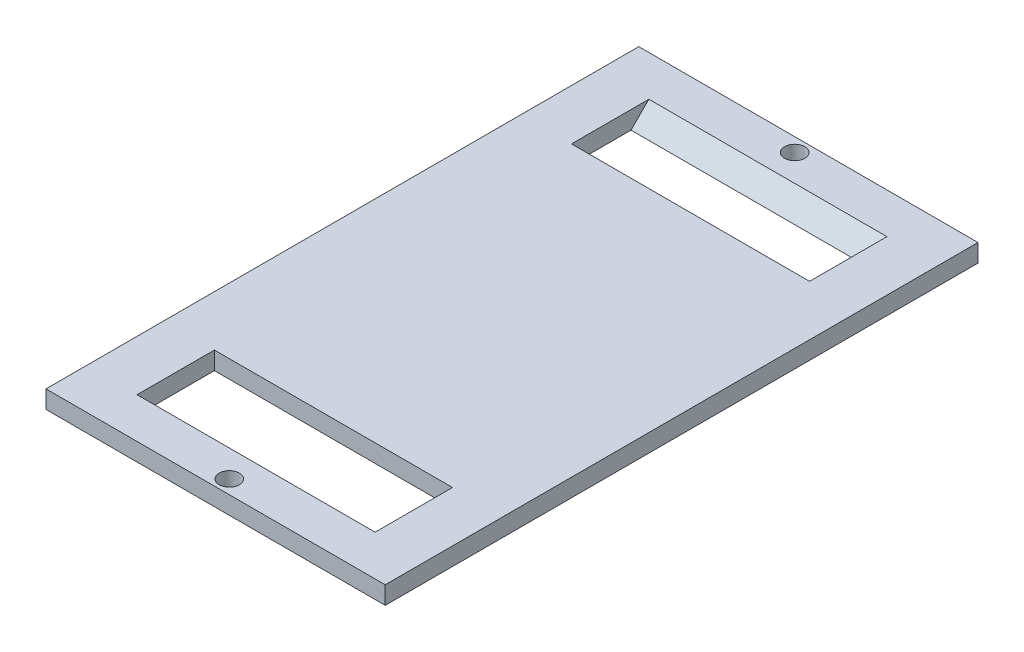
ISO-10303-21;
HEADER;
FILE_DESCRIPTION(('STEP AP214'),'2;1');
FILE_NAME('part.step','',(''),(''),'','','');
FILE_SCHEMA(('AUTOMOTIVE_DESIGN { 1 0 10303 214 1 1 1 1 }'));
ENDSEC;
DATA;
#1=APPLICATION_CONTEXT('core data for automotive mechanical design processes');
#2=APPLICATION_PROTOCOL_DEFINITION('international standard','automotive_design',2000,#1);
#3=PRODUCT_CONTEXT('',#1,'mechanical');
#4=PRODUCT('Part','Part','',(#3));
#5=PRODUCT_RELATED_PRODUCT_CATEGORY('part','',(#4));
#6=PRODUCT_DEFINITION_FORMATION('','',#4);
#7=PRODUCT_DEFINITION_CONTEXT('part definition',#1,'design');
#8=PRODUCT_DEFINITION('design','',#6,#7);
#9=PRODUCT_DEFINITION_SHAPE('','',#8);
#10=(LENGTH_UNIT() NAMED_UNIT(*) SI_UNIT(.MILLI.,.METRE.));
#11=(NAMED_UNIT(*) PLANE_ANGLE_UNIT() SI_UNIT($,.RADIAN.));
#12=(NAMED_UNIT(*) SI_UNIT($,.STERADIAN.) SOLID_ANGLE_UNIT());
#13=UNCERTAINTY_MEASURE_WITH_UNIT(LENGTH_MEASURE(1.E-05),#10,'distance_accuracy_value','');
#14=(GEOMETRIC_REPRESENTATION_CONTEXT(3) GLOBAL_UNCERTAINTY_ASSIGNED_CONTEXT((#13)) GLOBAL_UNIT_ASSIGNED_CONTEXT((#10,
#11,#12)) REPRESENTATION_CONTEXT('',''));
#15=CARTESIAN_POINT('',(0.,0.,0.));
#16=DIRECTION('',(0.,0.,1.));
#17=DIRECTION('',(1.,0.,0.));
#18=AXIS2_PLACEMENT_3D('',#15,#16,#17);
#19=CARTESIAN_POINT('',(0.,3.,0.));
#20=DIRECTION('',(0.,1.,0.));
#21=DIRECTION('',(0.,0.,1.));
#22=AXIS2_PLACEMENT_3D('',#19,#20,#21);
#23=PLANE('',#22);
#24=DIRECTION('',(0.,0.,-1.));
#25=VECTOR('',#24,1.);
#26=CARTESIAN_POINT('',(20.,3.,30.));
#27=LINE('',#26,#25);
#28=CARTESIAN_POINT('',(20.,3.,43.));
#29=VERTEX_POINT('',#28);
#30=CARTESIAN_POINT('',(20.,3.,30.));
#31=VERTEX_POINT('',#30);
#32=EDGE_CURVE('E50',#29,#31,#27,.T.);
#33=ORIENTED_EDGE('',*,*,#32,.F.);
#34=DIRECTION('',(-1.,0.,0.));
#35=VECTOR('',#34,1.);
#36=CARTESIAN_POINT('',(-20.,3.,43.));
#37=LINE('',#36,#35);
#38=CARTESIAN_POINT('',(-20.,3.,43.));
#39=VERTEX_POINT('',#38);
#40=EDGE_CURVE('E223',#29,#39,#37,.T.);
#41=ORIENTED_EDGE('',*,*,#40,.T.);
#42=DIRECTION('',(0.,0.,1.));
#43=VECTOR('',#42,1.);
#44=CARTESIAN_POINT('',(-20.,3.,30.));
#45=LINE('',#44,#43);
#46=CARTESIAN_POINT('',(-20.,3.,30.));
#47=VERTEX_POINT('',#46);
#48=EDGE_CURVE('E58',#47,#39,#45,.T.);
#49=ORIENTED_EDGE('',*,*,#48,.F.);
#50=DIRECTION('',(-1.,0.,0.));
#51=VECTOR('',#50,1.);
#52=CARTESIAN_POINT('',(-20.,3.,30.));
#53=LINE('',#52,#51);
#54=EDGE_CURVE('E146',#31,#47,#53,.T.);
#55=ORIENTED_EDGE('',*,*,#54,.F.);
#56=EDGE_LOOP('',(#33,#41,#49,#55));
#57=FACE_BOUND('',#56,.T.);
#58=DIRECTION('',(0.,0.,1.));
#59=VECTOR('',#58,1.);
#60=CARTESIAN_POINT('',(-20.,3.,-40.));
#61=LINE('',#60,#59);
#62=CARTESIAN_POINT('',(-20.,3.,-43.));
#63=VERTEX_POINT('',#62);
#64=CARTESIAN_POINT('',(-20.,3.,-30.));
#65=VERTEX_POINT('',#64);
#66=EDGE_CURVE('E170',#63,#65,#61,.T.);
#67=ORIENTED_EDGE('',*,*,#66,.F.);
#68=DIRECTION('',(1.,0.,0.));
#69=VECTOR('',#68,1.);
#70=CARTESIAN_POINT('',(20.,3.,-43.));
#71=LINE('',#70,#69);
#72=CARTESIAN_POINT('',(20.,3.,-43.));
#73=VERTEX_POINT('',#72);
#74=EDGE_CURVE('E220',#63,#73,#71,.T.);
#75=ORIENTED_EDGE('',*,*,#74,.T.);
#76=DIRECTION('',(0.,0.,-1.));
#77=VECTOR('',#76,1.);
#78=CARTESIAN_POINT('',(20.,3.,-40.));
#79=LINE('',#78,#77);
#80=CARTESIAN_POINT('',(20.,3.,-30.));
#81=VERTEX_POINT('',#80);
#82=EDGE_CURVE('E153',#81,#73,#79,.T.);
#83=ORIENTED_EDGE('',*,*,#82,.F.);
#84=DIRECTION('',(1.,0.,0.));
#85=VECTOR('',#84,1.);
#86=CARTESIAN_POINT('',(-20.,3.,-30.));
#87=LINE('',#86,#85);
#88=EDGE_CURVE('E159',#65,#81,#87,.T.);
#89=ORIENTED_EDGE('',*,*,#88,.F.);
#90=EDGE_LOOP('',(#67,#75,#83,#89));
#91=FACE_BOUND('',#90,.T.);
#92=CARTESIAN_POINT('',(0.,3.,-47.5));
#93=DIRECTION('',(0.,1.,0.));
#94=DIRECTION('',(0.,0.,1.));
#95=AXIS2_PLACEMENT_3D('',#92,#93,#94);
#96=CIRCLE('',#95,1.7);
#97=CARTESIAN_POINT('',(0.,3.,-45.8));
#98=VERTEX_POINT('',#97);
#99=EDGE_CURVE('E185',#98,#98,#96,.T.);
#100=ORIENTED_EDGE('',*,*,#99,.F.);
#101=EDGE_LOOP('',(#100));
#102=FACE_BOUND('',#101,.T.);
#103=DIRECTION('',(0.,0.,-1.));
#104=VECTOR('',#103,1.);
#105=CARTESIAN_POINT('',(28.5,3.,-49.8));
#106=LINE('',#105,#104);
#107=CARTESIAN_POINT('',(28.5,3.,49.8));
#108=VERTEX_POINT('',#107);
#109=CARTESIAN_POINT('',(28.5,3.,-49.8));
#110=VERTEX_POINT('',#109);
#111=EDGE_CURVE('E191',#108,#110,#106,.T.);
#112=ORIENTED_EDGE('',*,*,#111,.T.);
#113=DIRECTION('',(-1.,0.,0.));
#114=VECTOR('',#113,1.);
#115=CARTESIAN_POINT('',(-28.5,3.,-49.8));
#116=LINE('',#115,#114);
#117=CARTESIAN_POINT('',(-28.5,3.,-49.8));
#118=VERTEX_POINT('',#117);
#119=EDGE_CURVE('E194',#110,#118,#116,.T.);
#120=ORIENTED_EDGE('',*,*,#119,.T.);
#121=DIRECTION('',(0.,0.,1.));
#122=VECTOR('',#121,1.);
#123=CARTESIAN_POINT('',(-28.5,3.,-49.8));
#124=LINE('',#123,#122);
#125=CARTESIAN_POINT('',(-28.5,3.,49.8));
#126=VERTEX_POINT('',#125);
#127=EDGE_CURVE('E197',#118,#126,#124,.T.);
#128=ORIENTED_EDGE('',*,*,#127,.T.);
#129=DIRECTION('',(1.,0.,0.));
#130=VECTOR('',#129,1.);
#131=CARTESIAN_POINT('',(-28.5,3.,49.8));
#132=LINE('',#131,#130);
#133=EDGE_CURVE('E199',#126,#108,#132,.T.);
#134=ORIENTED_EDGE('',*,*,#133,.T.);
#135=EDGE_LOOP('',(#112,#120,#128,#134));
#136=FACE_BOUND('',#135,.T.);
#137=CARTESIAN_POINT('',(0.,3.,47.5));
#138=DIRECTION('',(0.,1.,0.));
#139=DIRECTION('',(0.,0.,1.));
#140=AXIS2_PLACEMENT_3D('',#137,#138,#139);
#141=CIRCLE('',#140,1.7);
#142=CARTESIAN_POINT('',(0.,3.,49.2));
#143=VERTEX_POINT('',#142);
#144=EDGE_CURVE('E179',#143,#143,#141,.T.);
#145=ORIENTED_EDGE('',*,*,#144,.F.);
#146=EDGE_LOOP('',(#145));
#147=FACE_BOUND('',#146,.T.);
#148=ADVANCED_FACE('F35',(#57,#91,#102,#136,#147),#23,.T.);
#149=CARTESIAN_POINT('',(0.,0.,0.));
#150=DIRECTION('',(0.,1.,0.));
#151=DIRECTION('',(0.,0.,1.));
#152=AXIS2_PLACEMENT_3D('',#149,#150,#151);
#153=PLANE('',#152);
#154=DIRECTION('',(1.,0.,0.));
#155=VECTOR('',#154,1.);
#156=CARTESIAN_POINT('',(-20.,0.,40.));
#157=LINE('',#156,#155);
#158=CARTESIAN_POINT('',(-20.,0.,40.));
#159=VERTEX_POINT('',#158);
#160=CARTESIAN_POINT('',(20.,0.,40.));
#161=VERTEX_POINT('',#160);
#162=EDGE_CURVE('E132',#159,#161,#157,.T.);
#163=ORIENTED_EDGE('',*,*,#162,.T.);
#164=DIRECTION('',(0.,0.,-1.));
#165=VECTOR('',#164,1.);
#166=CARTESIAN_POINT('',(20.,0.,30.));
#167=LINE('',#166,#165);
#168=CARTESIAN_POINT('',(20.,0.,30.));
#169=VERTEX_POINT('',#168);
#170=EDGE_CURVE('E127',#161,#169,#167,.T.);
#171=ORIENTED_EDGE('',*,*,#170,.T.);
#172=DIRECTION('',(-1.,0.,0.));
#173=VECTOR('',#172,1.);
#174=CARTESIAN_POINT('',(-20.,0.,30.));
#175=LINE('',#174,#173);
#176=CARTESIAN_POINT('',(-20.,0.,30.));
#177=VERTEX_POINT('',#176);
#178=EDGE_CURVE('E136',#169,#177,#175,.T.);
#179=ORIENTED_EDGE('',*,*,#178,.T.);
#180=DIRECTION('',(0.,0.,1.));
#181=VECTOR('',#180,1.);
#182=CARTESIAN_POINT('',(-20.,0.,30.));
#183=LINE('',#182,#181);
#184=EDGE_CURVE('E140',#177,#159,#183,.T.);
#185=ORIENTED_EDGE('',*,*,#184,.T.);
#186=EDGE_LOOP('',(#163,#171,#179,#185));
#187=FACE_BOUND('',#186,.T.);
#188=DIRECTION('',(1.,0.,0.));
#189=VECTOR('',#188,1.);
#190=CARTESIAN_POINT('',(-20.,0.,-30.));
#191=LINE('',#190,#189);
#192=CARTESIAN_POINT('',(-20.,0.,-30.));
#193=VERTEX_POINT('',#192);
#194=CARTESIAN_POINT('',(20.,0.,-30.));
#195=VERTEX_POINT('',#194);
#196=EDGE_CURVE('E165',#193,#195,#191,.T.);
#197=ORIENTED_EDGE('',*,*,#196,.T.);
#198=DIRECTION('',(0.,0.,-1.));
#199=VECTOR('',#198,1.);
#200=CARTESIAN_POINT('',(20.,0.,-40.));
#201=LINE('',#200,#199);
#202=CARTESIAN_POINT('',(20.,0.,-40.));
#203=VERTEX_POINT('',#202);
#204=EDGE_CURVE('E155',#195,#203,#201,.T.);
#205=ORIENTED_EDGE('',*,*,#204,.T.);
#206=DIRECTION('',(-1.,0.,0.));
#207=VECTOR('',#206,1.);
#208=CARTESIAN_POINT('',(-20.,0.,-40.));
#209=LINE('',#208,#207);
#210=CARTESIAN_POINT('',(-20.,0.,-40.));
#211=VERTEX_POINT('',#210);
#212=EDGE_CURVE('E158',#203,#211,#209,.T.);
#213=ORIENTED_EDGE('',*,*,#212,.T.);
#214=DIRECTION('',(0.,0.,1.));
#215=VECTOR('',#214,1.);
#216=CARTESIAN_POINT('',(-20.,0.,-40.));
#217=LINE('',#216,#215);
#218=EDGE_CURVE('E162',#211,#193,#217,.T.);
#219=ORIENTED_EDGE('',*,*,#218,.T.);
#220=EDGE_LOOP('',(#197,#205,#213,#219));
#221=FACE_BOUND('',#220,.T.);
#222=DIRECTION('',(0.,0.,-1.));
#223=VECTOR('',#222,1.);
#224=CARTESIAN_POINT('',(28.5,0.,-49.8));
#225=LINE('',#224,#223);
#226=CARTESIAN_POINT('',(28.5,0.,49.8));
#227=VERTEX_POINT('',#226);
#228=CARTESIAN_POINT('',(28.5,0.,-49.8));
#229=VERTEX_POINT('',#228);
#230=EDGE_CURVE('E188',#227,#229,#225,.T.);
#231=ORIENTED_EDGE('',*,*,#230,.F.);
#232=DIRECTION('',(1.,0.,0.));
#233=VECTOR('',#232,1.);
#234=CARTESIAN_POINT('',(-28.5,0.,49.8));
#235=LINE('',#234,#233);
#236=CARTESIAN_POINT('',(-28.5,0.,49.8));
#237=VERTEX_POINT('',#236);
#238=EDGE_CURVE('E195',#237,#227,#235,.T.);
#239=ORIENTED_EDGE('',*,*,#238,.F.);
#240=DIRECTION('',(0.,0.,1.));
#241=VECTOR('',#240,1.);
#242=CARTESIAN_POINT('',(-28.5,0.,-49.8));
#243=LINE('',#242,#241);
#244=CARTESIAN_POINT('',(-28.5,0.,-49.8));
#245=VERTEX_POINT('',#244);
#246=EDGE_CURVE('E206',#245,#237,#243,.T.);
#247=ORIENTED_EDGE('',*,*,#246,.F.);
#248=DIRECTION('',(-1.,0.,0.));
#249=VECTOR('',#248,1.);
#250=CARTESIAN_POINT('',(-28.5,0.,-49.8));
#251=LINE('',#250,#249);
#252=EDGE_CURVE('E204',#229,#245,#251,.T.);
#253=ORIENTED_EDGE('',*,*,#252,.F.);
#254=EDGE_LOOP('',(#231,#239,#247,#253));
#255=FACE_BOUND('',#254,.T.);
#256=CARTESIAN_POINT('',(0.,0.,-47.5));
#257=DIRECTION('',(0.,1.,0.));
#258=DIRECTION('',(0.,0.,1.));
#259=AXIS2_PLACEMENT_3D('',#256,#257,#258);
#260=CIRCLE('',#259,1.7);
#261=CARTESIAN_POINT('',(0.,0.,-45.8));
#262=VERTEX_POINT('',#261);
#263=EDGE_CURVE('E182',#262,#262,#260,.T.);
#264=ORIENTED_EDGE('',*,*,#263,.T.);
#265=EDGE_LOOP('',(#264));
#266=FACE_BOUND('',#265,.T.);
#267=CARTESIAN_POINT('',(0.,0.,47.5));
#268=DIRECTION('',(0.,1.,0.));
#269=DIRECTION('',(0.,0.,1.));
#270=AXIS2_PLACEMENT_3D('',#267,#268,#269);
#271=CIRCLE('',#270,1.7);
#272=CARTESIAN_POINT('',(0.,0.,49.2));
#273=VERTEX_POINT('',#272);
#274=EDGE_CURVE('E177',#273,#273,#271,.T.);
#275=ORIENTED_EDGE('',*,*,#274,.T.);
#276=EDGE_LOOP('',(#275));
#277=FACE_BOUND('',#276,.T.);
#278=ADVANCED_FACE('F142',(#187,#221,#255,#266,#277),#153,.F.);
#279=CARTESIAN_POINT('',(28.5,3.,-49.8));
#280=DIRECTION('',(-1.,0.,0.));
#281=DIRECTION('',(0.,0.,1.));
#282=AXIS2_PLACEMENT_3D('',#279,#280,#281);
#283=PLANE('',#282);
#284=ORIENTED_EDGE('',*,*,#230,.T.);
#285=DIRECTION('',(0.,-1.,0.));
#286=VECTOR('',#285,1.);
#287=CARTESIAN_POINT('',(28.5,3.,-49.8));
#288=LINE('',#287,#286);
#289=EDGE_CURVE('E217',#110,#229,#288,.T.);
#290=ORIENTED_EDGE('',*,*,#289,.F.);
#291=ORIENTED_EDGE('',*,*,#111,.F.);
#292=DIRECTION('',(0.,-1.,0.));
#293=VECTOR('',#292,1.);
#294=CARTESIAN_POINT('',(28.5,3.,49.8));
#295=LINE('',#294,#293);
#296=EDGE_CURVE('E201',#108,#227,#295,.T.);
#297=ORIENTED_EDGE('',*,*,#296,.T.);
#298=EDGE_LOOP('',(#284,#290,#291,#297));
#299=FACE_BOUND('',#298,.T.);
#300=ADVANCED_FACE('F264',(#299),#283,.F.);
#301=CARTESIAN_POINT('',(-28.5,3.,-49.8));
#302=DIRECTION('',(0.,0.,1.));
#303=DIRECTION('',(1.,0.,0.));
#304=AXIS2_PLACEMENT_3D('',#301,#302,#303);
#305=PLANE('',#304);
#306=ORIENTED_EDGE('',*,*,#252,.T.);
#307=DIRECTION('',(0.,-1.,0.));
#308=VECTOR('',#307,1.);
#309=CARTESIAN_POINT('',(-28.5,3.,-49.8));
#310=LINE('',#309,#308);
#311=EDGE_CURVE('E214',#118,#245,#310,.T.);
#312=ORIENTED_EDGE('',*,*,#311,.F.);
#313=ORIENTED_EDGE('',*,*,#119,.F.);
#314=ORIENTED_EDGE('',*,*,#289,.T.);
#315=EDGE_LOOP('',(#306,#312,#313,#314));
#316=FACE_BOUND('',#315,.T.);
#317=ADVANCED_FACE('F275',(#316),#305,.F.);
#318=CARTESIAN_POINT('',(-28.5,3.,-49.8));
#319=DIRECTION('',(1.,0.,0.));
#320=DIRECTION('',(0.,0.,-1.));
#321=AXIS2_PLACEMENT_3D('',#318,#319,#320);
#322=PLANE('',#321);
#323=ORIENTED_EDGE('',*,*,#246,.T.);
#324=DIRECTION('',(0.,-1.,0.));
#325=VECTOR('',#324,1.);
#326=CARTESIAN_POINT('',(-28.5,3.,49.8));
#327=LINE('',#326,#325);
#328=EDGE_CURVE('E211',#126,#237,#327,.T.);
#329=ORIENTED_EDGE('',*,*,#328,.F.);
#330=ORIENTED_EDGE('',*,*,#127,.F.);
#331=ORIENTED_EDGE('',*,*,#311,.T.);
#332=EDGE_LOOP('',(#323,#329,#330,#331));
#333=FACE_BOUND('',#332,.T.);
#334=ADVANCED_FACE('F271',(#333),#322,.F.);
#335=CARTESIAN_POINT('',(-28.5,3.,49.8));
#336=DIRECTION('',(0.,0.,-1.));
#337=DIRECTION('',(-1.,0.,0.));
#338=AXIS2_PLACEMENT_3D('',#335,#336,#337);
#339=PLANE('',#338);
#340=ORIENTED_EDGE('',*,*,#238,.T.);
#341=ORIENTED_EDGE('',*,*,#296,.F.);
#342=ORIENTED_EDGE('',*,*,#133,.F.);
#343=ORIENTED_EDGE('',*,*,#328,.T.);
#344=EDGE_LOOP('',(#340,#341,#342,#343));
#345=FACE_BOUND('',#344,.T.);
#346=ADVANCED_FACE('F268',(#345),#339,.F.);
#347=CARTESIAN_POINT('',(0.,3.,-47.5));
#348=DIRECTION('',(0.,-1.,0.));
#349=DIRECTION('',(0.,0.,-1.));
#350=AXIS2_PLACEMENT_3D('',#347,#348,#349);
#351=CYLINDRICAL_SURFACE('',#350,1.7);
#352=ORIENTED_EDGE('',*,*,#99,.T.);
#353=EDGE_LOOP('',(#352));
#354=FACE_BOUND('',#353,.T.);
#355=ORIENTED_EDGE('',*,*,#263,.F.);
#356=EDGE_LOOP('',(#355));
#357=FACE_BOUND('',#356,.T.);
#358=ADVANCED_FACE('F255',(#354,#357),#351,.F.);
#359=CARTESIAN_POINT('',(0.,3.,47.5));
#360=DIRECTION('',(0.,-1.,0.));
#361=DIRECTION('',(0.,0.,-1.));
#362=AXIS2_PLACEMENT_3D('',#359,#360,#361);
#363=CYLINDRICAL_SURFACE('',#362,1.7);
#364=ORIENTED_EDGE('',*,*,#144,.T.);
#365=EDGE_LOOP('',(#364));
#366=FACE_BOUND('',#365,.T.);
#367=ORIENTED_EDGE('',*,*,#274,.F.);
#368=EDGE_LOOP('',(#367));
#369=FACE_BOUND('',#368,.T.);
#370=ADVANCED_FACE('F248',(#366,#369),#363,.F.);
#371=CARTESIAN_POINT('',(20.,0.,-40.));
#372=DIRECTION('',(1.,0.,0.));
#373=DIRECTION('',(0.,0.,-1.));
#374=AXIS2_PLACEMENT_3D('',#371,#372,#373);
#375=PLANE('',#374);
#376=ORIENTED_EDGE('',*,*,#82,.T.);
#377=DIRECTION('',(0.,-0.707106781186546,0.707106781186549));
#378=VECTOR('',#377,1.);
#379=CARTESIAN_POINT('',(20.,0.,-40.));
#380=LINE('',#379,#378);
#381=EDGE_CURVE('E11',#73,#203,#380,.T.);
#382=ORIENTED_EDGE('',*,*,#381,.T.);
#383=ORIENTED_EDGE('',*,*,#204,.F.);
#384=DIRECTION('',(0.,1.,0.));
#385=VECTOR('',#384,1.);
#386=CARTESIAN_POINT('',(20.,0.,-30.));
#387=LINE('',#386,#385);
#388=EDGE_CURVE('E175',#195,#81,#387,.T.);
#389=ORIENTED_EDGE('',*,*,#388,.T.);
#390=EDGE_LOOP('',(#376,#382,#383,#389));
#391=FACE_BOUND('',#390,.T.);
#392=ADVANCED_FACE('F246',(#391),#375,.F.);
#393=CARTESIAN_POINT('',(-20.,0.,-30.));
#394=DIRECTION('',(0.,0.,1.));
#395=DIRECTION('',(1.,0.,0.));
#396=AXIS2_PLACEMENT_3D('',#393,#394,#395);
#397=PLANE('',#396);
#398=ORIENTED_EDGE('',*,*,#88,.T.);
#399=ORIENTED_EDGE('',*,*,#388,.F.);
#400=ORIENTED_EDGE('',*,*,#196,.F.);
#401=DIRECTION('',(0.,1.,0.));
#402=VECTOR('',#401,1.);
#403=CARTESIAN_POINT('',(-20.,0.,-30.));
#404=LINE('',#403,#402);
#405=EDGE_CURVE('E168',#193,#65,#404,.T.);
#406=ORIENTED_EDGE('',*,*,#405,.T.);
#407=EDGE_LOOP('',(#398,#399,#400,#406));
#408=FACE_BOUND('',#407,.T.);
#409=ADVANCED_FACE('F241',(#408),#397,.F.);
#410=CARTESIAN_POINT('',(-20.,0.,-40.));
#411=DIRECTION('',(-1.,0.,0.));
#412=DIRECTION('',(0.,0.,1.));
#413=AXIS2_PLACEMENT_3D('',#410,#411,#412);
#414=PLANE('',#413);
#415=ORIENTED_EDGE('',*,*,#66,.T.);
#416=ORIENTED_EDGE('',*,*,#405,.F.);
#417=ORIENTED_EDGE('',*,*,#218,.F.);
#418=DIRECTION('',(0.,0.707106781186546,-0.707106781186549));
#419=VECTOR('',#418,1.);
#420=CARTESIAN_POINT('',(-20.,0.,-40.));
#421=LINE('',#420,#419);
#422=EDGE_CURVE('E43',#211,#63,#421,.T.);
#423=ORIENTED_EDGE('',*,*,#422,.T.);
#424=EDGE_LOOP('',(#415,#416,#417,#423));
#425=FACE_BOUND('',#424,.T.);
#426=ADVANCED_FACE('F232',(#425),#414,.F.);
#427=CARTESIAN_POINT('',(20.,0.,30.));
#428=DIRECTION('',(1.,0.,0.));
#429=DIRECTION('',(0.,0.,-1.));
#430=AXIS2_PLACEMENT_3D('',#427,#428,#429);
#431=PLANE('',#430);
#432=ORIENTED_EDGE('',*,*,#32,.T.);
#433=DIRECTION('',(0.,1.,0.));
#434=VECTOR('',#433,1.);
#435=CARTESIAN_POINT('',(20.,0.,30.));
#436=LINE('',#435,#434);
#437=EDGE_CURVE('E123',#169,#31,#436,.T.);
#438=ORIENTED_EDGE('',*,*,#437,.F.);
#439=ORIENTED_EDGE('',*,*,#170,.F.);
#440=DIRECTION('',(0.,0.707106781186546,0.707106781186549));
#441=VECTOR('',#440,1.);
#442=CARTESIAN_POINT('',(20.,-5.,35.));
#443=LINE('',#442,#441);
#444=EDGE_CURVE('E225',#161,#29,#443,.T.);
#445=ORIENTED_EDGE('',*,*,#444,.T.);
#446=EDGE_LOOP('',(#432,#438,#439,#445));
#447=FACE_BOUND('',#446,.T.);
#448=ADVANCED_FACE('F125',(#447),#431,.F.);
#449=CARTESIAN_POINT('',(-20.,0.,30.));
#450=DIRECTION('',(-1.,0.,0.));
#451=DIRECTION('',(0.,0.,1.));
#452=AXIS2_PLACEMENT_3D('',#449,#450,#451);
#453=PLANE('',#452);
#454=ORIENTED_EDGE('',*,*,#48,.T.);
#455=DIRECTION('',(0.,-0.707106781186546,-0.707106781186549));
#456=VECTOR('',#455,1.);
#457=CARTESIAN_POINT('',(-20.,-5.,35.));
#458=LINE('',#457,#456);
#459=EDGE_CURVE('E227',#39,#159,#458,.T.);
#460=ORIENTED_EDGE('',*,*,#459,.T.);
#461=ORIENTED_EDGE('',*,*,#184,.F.);
#462=DIRECTION('',(0.,1.,0.));
#463=VECTOR('',#462,1.);
#464=CARTESIAN_POINT('',(-20.,0.,30.));
#465=LINE('',#464,#463);
#466=EDGE_CURVE('E131',#177,#47,#465,.T.);
#467=ORIENTED_EDGE('',*,*,#466,.T.);
#468=EDGE_LOOP('',(#454,#460,#461,#467));
#469=FACE_BOUND('',#468,.T.);
#470=ADVANCED_FACE('F289',(#469),#453,.F.);
#471=CARTESIAN_POINT('',(-20.,0.,30.));
#472=DIRECTION('',(0.,0.,-1.));
#473=DIRECTION('',(-1.,0.,0.));
#474=AXIS2_PLACEMENT_3D('',#471,#472,#473);
#475=PLANE('',#474);
#476=ORIENTED_EDGE('',*,*,#54,.T.);
#477=ORIENTED_EDGE('',*,*,#466,.F.);
#478=ORIENTED_EDGE('',*,*,#178,.F.);
#479=ORIENTED_EDGE('',*,*,#437,.T.);
#480=EDGE_LOOP('',(#476,#477,#478,#479));
#481=FACE_BOUND('',#480,.T.);
#482=ADVANCED_FACE('F137',(#481),#475,.F.);
#483=CARTESIAN_POINT('',(-20.,0.,40.));
#484=DIRECTION('',(0.,0.707106781186549,-0.707106781186546));
#485=DIRECTION('',(-1.,0.,0.));
#486=AXIS2_PLACEMENT_3D('',#483,#484,#485);
#487=PLANE('',#486);
#488=ORIENTED_EDGE('',*,*,#459,.F.);
#489=ORIENTED_EDGE('',*,*,#40,.F.);
#490=ORIENTED_EDGE('',*,*,#444,.F.);
#491=ORIENTED_EDGE('',*,*,#162,.F.);
#492=EDGE_LOOP('',(#488,#489,#490,#491));
#493=FACE_BOUND('',#492,.T.);
#494=ADVANCED_FACE('F282',(#493),#487,.T.);
#495=CARTESIAN_POINT('',(-20.,0.,-40.));
#496=DIRECTION('',(0.,0.707106781186549,0.707106781186546));
#497=DIRECTION('',(1.,0.,0.));
#498=AXIS2_PLACEMENT_3D('',#495,#496,#497);
#499=PLANE('',#498);
#500=ORIENTED_EDGE('',*,*,#381,.F.);
#501=ORIENTED_EDGE('',*,*,#74,.F.);
#502=ORIENTED_EDGE('',*,*,#422,.F.);
#503=ORIENTED_EDGE('',*,*,#212,.F.);
#504=EDGE_LOOP('',(#500,#501,#502,#503));
#505=FACE_BOUND('',#504,.T.);
#506=ADVANCED_FACE('F37',(#505),#499,.T.);
#507=CLOSED_SHELL('',(#148,#278,#300,#317,#334,#346,#358,#370,#392,#409,#426,#448,#470,#482,
#494,#506));
#508=MANIFOLD_SOLID_BREP('B2',#507);
#509=ADVANCED_BREP_SHAPE_REPRESENTATION('',(#18,#508),#14);
#510=SHAPE_DEFINITION_REPRESENTATION(#9,#509);
ENDSEC;
END-ISO-10303-21;
